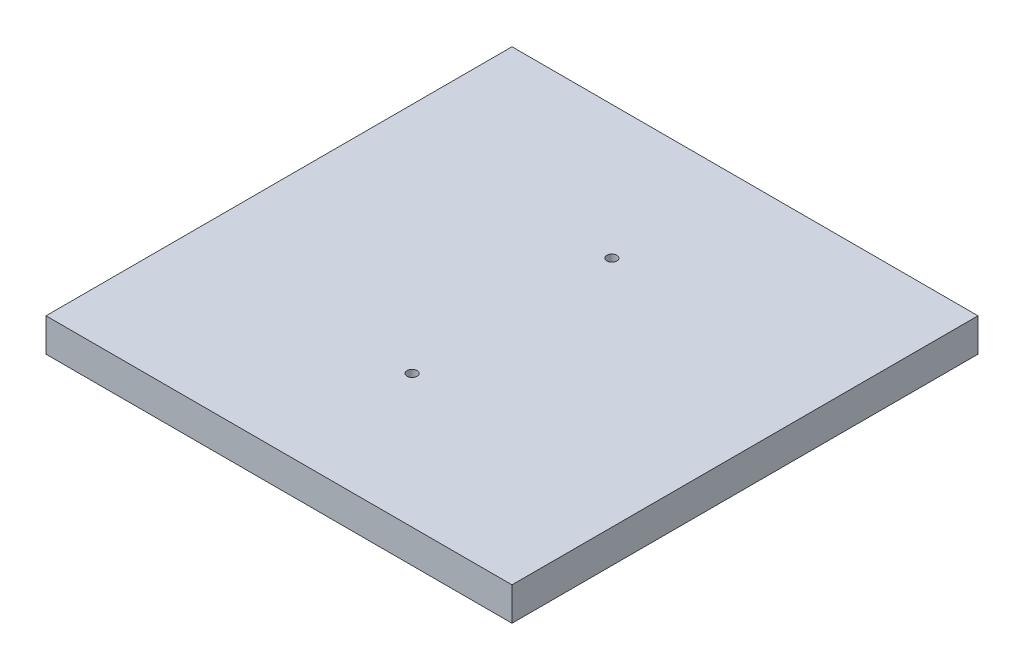
ISO-10303-21;
HEADER;
FILE_DESCRIPTION(('STEP AP214'),'2;1');
FILE_NAME('part.step','',(''),(''),'','','');
FILE_SCHEMA(('AUTOMOTIVE_DESIGN { 1 0 10303 214 1 1 1 1 }'));
ENDSEC;
DATA;
#1=APPLICATION_CONTEXT('core data for automotive mechanical design processes');
#2=APPLICATION_PROTOCOL_DEFINITION('international standard','automotive_design',2000,#1);
#3=PRODUCT_CONTEXT('',#1,'mechanical');
#4=PRODUCT('Part','Part','',(#3));
#5=PRODUCT_RELATED_PRODUCT_CATEGORY('part','',(#4));
#6=PRODUCT_DEFINITION_FORMATION('','',#4);
#7=PRODUCT_DEFINITION_CONTEXT('part definition',#1,'design');
#8=PRODUCT_DEFINITION('design','',#6,#7);
#9=PRODUCT_DEFINITION_SHAPE('','',#8);
#10=(LENGTH_UNIT() NAMED_UNIT(*) SI_UNIT(.MILLI.,.METRE.));
#11=(NAMED_UNIT(*) PLANE_ANGLE_UNIT() SI_UNIT($,.RADIAN.));
#12=(NAMED_UNIT(*) SI_UNIT($,.STERADIAN.) SOLID_ANGLE_UNIT());
#13=UNCERTAINTY_MEASURE_WITH_UNIT(LENGTH_MEASURE(1.E-05),#10,'distance_accuracy_value','');
#14=(GEOMETRIC_REPRESENTATION_CONTEXT(3) GLOBAL_UNCERTAINTY_ASSIGNED_CONTEXT((#13)) GLOBAL_UNIT_ASSIGNED_CONTEXT((#10,
#11,#12)) REPRESENTATION_CONTEXT('',''));
#15=CARTESIAN_POINT('',(0.,0.,0.));
#16=DIRECTION('',(0.,0.,1.));
#17=DIRECTION('',(1.,0.,0.));
#18=AXIS2_PLACEMENT_3D('',#15,#16,#17);
#19=CARTESIAN_POINT('',(-35.,-4.99999999999999,35.));
#20=DIRECTION('',(1.,0.,0.));
#21=DIRECTION('',(0.,0.,-1.));
#22=AXIS2_PLACEMENT_3D('',#19,#20,#21);
#23=PLANE('',#22);
#24=DIRECTION('',(0.,0.,-1.));
#25=VECTOR('',#24,1.);
#26=CARTESIAN_POINT('',(-35.,0.,35.));
#27=LINE('',#26,#25);
#28=CARTESIAN_POINT('',(-35.,0.,35.));
#29=VERTEX_POINT('',#28);
#30=CARTESIAN_POINT('',(-35.,0.,-35.));
#31=VERTEX_POINT('',#30);
#32=EDGE_CURVE('E95',#29,#31,#27,.T.);
#33=ORIENTED_EDGE('',*,*,#32,.T.);
#34=DIRECTION('',(0.,1.,0.));
#35=VECTOR('',#34,1.);
#36=CARTESIAN_POINT('',(-35.,-4.99999999999999,-35.));
#37=LINE('',#36,#35);
#38=CARTESIAN_POINT('',(-35.,-4.99999999999999,-35.));
#39=VERTEX_POINT('',#38);
#40=EDGE_CURVE('E11',#39,#31,#37,.T.);
#41=ORIENTED_EDGE('',*,*,#40,.F.);
#42=DIRECTION('',(0.,0.,-1.));
#43=VECTOR('',#42,1.);
#44=CARTESIAN_POINT('',(-35.,-4.99999999999999,35.));
#45=LINE('',#44,#43);
#46=CARTESIAN_POINT('',(-35.,-4.99999999999999,35.));
#47=VERTEX_POINT('',#46);
#48=EDGE_CURVE('E81',#47,#39,#45,.T.);
#49=ORIENTED_EDGE('',*,*,#48,.F.);
#50=DIRECTION('',(0.,1.,0.));
#51=VECTOR('',#50,1.);
#52=CARTESIAN_POINT('',(-35.,-4.99999999999999,35.));
#53=LINE('',#52,#51);
#54=EDGE_CURVE('E48',#47,#29,#53,.T.);
#55=ORIENTED_EDGE('',*,*,#54,.T.);
#56=EDGE_LOOP('',(#33,#41,#49,#55));
#57=FACE_BOUND('',#56,.T.);
#58=ADVANCED_FACE('F32',(#57),#23,.F.);
#59=CARTESIAN_POINT('',(-35.,-4.99999999999999,-35.));
#60=DIRECTION('',(0.,0.,1.));
#61=DIRECTION('',(1.,0.,0.));
#62=AXIS2_PLACEMENT_3D('',#59,#60,#61);
#63=PLANE('',#62);
#64=DIRECTION('',(1.,0.,0.));
#65=VECTOR('',#64,1.);
#66=CARTESIAN_POINT('',(-35.,0.,-35.));
#67=LINE('',#66,#65);
#68=CARTESIAN_POINT('',(35.,0.,-35.));
#69=VERTEX_POINT('',#68);
#70=EDGE_CURVE('E86',#31,#69,#67,.T.);
#71=ORIENTED_EDGE('',*,*,#70,.T.);
#72=DIRECTION('',(0.,1.,0.));
#73=VECTOR('',#72,1.);
#74=CARTESIAN_POINT('',(35.,-4.99999999999999,-35.));
#75=LINE('',#74,#73);
#76=CARTESIAN_POINT('',(35.,-4.99999999999999,-35.));
#77=VERTEX_POINT('',#76);
#78=EDGE_CURVE('E40',#77,#69,#75,.T.);
#79=ORIENTED_EDGE('',*,*,#78,.F.);
#80=DIRECTION('',(1.,0.,0.));
#81=VECTOR('',#80,1.);
#82=CARTESIAN_POINT('',(-35.,-4.99999999999999,-35.));
#83=LINE('',#82,#81);
#84=EDGE_CURVE('E73',#39,#77,#83,.T.);
#85=ORIENTED_EDGE('',*,*,#84,.F.);
#86=ORIENTED_EDGE('',*,*,#40,.T.);
#87=EDGE_LOOP('',(#71,#79,#85,#86));
#88=FACE_BOUND('',#87,.T.);
#89=ADVANCED_FACE('F85',(#88),#63,.F.);
#90=CARTESIAN_POINT('',(35.,-4.99999999999999,35.));
#91=DIRECTION('',(1.,0.,0.));
#92=DIRECTION('',(0.,0.,-1.));
#93=AXIS2_PLACEMENT_3D('',#90,#91,#92);
#94=PLANE('',#93);
#95=DIRECTION('',(0.,0.,-1.));
#96=VECTOR('',#95,1.);
#97=CARTESIAN_POINT('',(35.,0.,35.));
#98=LINE('',#97,#96);
#99=CARTESIAN_POINT('',(35.,0.,35.));
#100=VERTEX_POINT('',#99);
#101=EDGE_CURVE('E99',#100,#69,#98,.T.);
#102=ORIENTED_EDGE('',*,*,#101,.F.);
#103=DIRECTION('',(0.,1.,0.));
#104=VECTOR('',#103,1.);
#105=CARTESIAN_POINT('',(35.,-4.99999999999999,35.));
#106=LINE('',#105,#104);
#107=CARTESIAN_POINT('',(35.,-4.99999999999999,35.));
#108=VERTEX_POINT('',#107);
#109=EDGE_CURVE('E62',#108,#100,#106,.T.);
#110=ORIENTED_EDGE('',*,*,#109,.F.);
#111=DIRECTION('',(0.,0.,-1.));
#112=VECTOR('',#111,1.);
#113=CARTESIAN_POINT('',(35.,-4.99999999999999,35.));
#114=LINE('',#113,#112);
#115=EDGE_CURVE('E80',#108,#77,#114,.T.);
#116=ORIENTED_EDGE('',*,*,#115,.T.);
#117=ORIENTED_EDGE('',*,*,#78,.T.);
#118=EDGE_LOOP('',(#102,#110,#116,#117));
#119=FACE_BOUND('',#118,.T.);
#120=ADVANCED_FACE('F89',(#119),#94,.T.);
#121=CARTESIAN_POINT('',(-35.,-4.99999999999999,35.));
#122=DIRECTION('',(0.,0.,1.));
#123=DIRECTION('',(1.,0.,0.));
#124=AXIS2_PLACEMENT_3D('',#121,#122,#123);
#125=PLANE('',#124);
#126=DIRECTION('',(1.,0.,0.));
#127=VECTOR('',#126,1.);
#128=CARTESIAN_POINT('',(-35.,0.,35.));
#129=LINE('',#128,#127);
#130=EDGE_CURVE('E101',#29,#100,#129,.T.);
#131=ORIENTED_EDGE('',*,*,#130,.F.);
#132=ORIENTED_EDGE('',*,*,#54,.F.);
#133=DIRECTION('',(1.,0.,0.));
#134=VECTOR('',#133,1.);
#135=CARTESIAN_POINT('',(-35.,-4.99999999999999,35.));
#136=LINE('',#135,#134);
#137=EDGE_CURVE('E90',#47,#108,#136,.T.);
#138=ORIENTED_EDGE('',*,*,#137,.T.);
#139=ORIENTED_EDGE('',*,*,#109,.T.);
#140=EDGE_LOOP('',(#131,#132,#138,#139));
#141=FACE_BOUND('',#140,.T.);
#142=ADVANCED_FACE('F133',(#141),#125,.T.);
#143=CARTESIAN_POINT('',(0.,-4.99999999999999,0.));
#144=DIRECTION('',(0.,-1.,0.));
#145=DIRECTION('',(0.,0.,-1.));
#146=AXIS2_PLACEMENT_3D('',#143,#144,#145);
#147=PLANE('',#146);
#148=CARTESIAN_POINT('',(0.,-4.99999999999999,-15.));
#149=DIRECTION('',(0.,1.,0.));
#150=DIRECTION('',(0.,0.,1.));
#151=AXIS2_PLACEMENT_3D('',#148,#149,#150);
#152=CIRCLE('',#151,0.75);
#153=CARTESIAN_POINT('',(0.,-4.99999999999999,-14.25));
#154=VERTEX_POINT('',#153);
#155=EDGE_CURVE('E97',#154,#154,#152,.T.);
#156=ORIENTED_EDGE('',*,*,#155,.T.);
#157=EDGE_LOOP('',(#156));
#158=FACE_BOUND('',#157,.T.);
#159=CARTESIAN_POINT('',(0.,-4.99999999999999,15.));
#160=DIRECTION('',(0.,1.,0.));
#161=DIRECTION('',(0.,0.,-1.));
#162=AXIS2_PLACEMENT_3D('',#159,#160,#161);
#163=CIRCLE('',#162,0.75);
#164=CARTESIAN_POINT('',(0.,-4.99999999999999,14.25));
#165=VERTEX_POINT('',#164);
#166=EDGE_CURVE('E110',#165,#165,#163,.T.);
#167=ORIENTED_EDGE('',*,*,#166,.T.);
#168=EDGE_LOOP('',(#167));
#169=FACE_BOUND('',#168,.T.);
#170=ORIENTED_EDGE('',*,*,#48,.T.);
#171=ORIENTED_EDGE('',*,*,#84,.T.);
#172=ORIENTED_EDGE('',*,*,#115,.F.);
#173=ORIENTED_EDGE('',*,*,#137,.F.);
#174=EDGE_LOOP('',(#170,#171,#172,#173));
#175=FACE_BOUND('',#174,.T.);
#176=ADVANCED_FACE('F77',(#158,#169,#175),#147,.T.);
#177=CARTESIAN_POINT('',(0.,0.,0.));
#178=DIRECTION('',(0.,-1.,0.));
#179=DIRECTION('',(0.,0.,-1.));
#180=AXIS2_PLACEMENT_3D('',#177,#178,#179);
#181=PLANE('',#180);
#182=CARTESIAN_POINT('',(0.,0.,-15.));
#183=DIRECTION('',(0.,1.,0.));
#184=DIRECTION('',(0.,0.,1.));
#185=AXIS2_PLACEMENT_3D('',#182,#183,#184);
#186=CIRCLE('',#185,0.75);
#187=CARTESIAN_POINT('',(0.,0.,-14.25));
#188=VERTEX_POINT('',#187);
#189=EDGE_CURVE('E113',#188,#188,#186,.T.);
#190=ORIENTED_EDGE('',*,*,#189,.F.);
#191=EDGE_LOOP('',(#190));
#192=FACE_BOUND('',#191,.T.);
#193=CARTESIAN_POINT('',(0.,0.,15.));
#194=DIRECTION('',(0.,1.,0.));
#195=DIRECTION('',(0.,0.,-1.));
#196=AXIS2_PLACEMENT_3D('',#193,#194,#195);
#197=CIRCLE('',#196,0.75);
#198=CARTESIAN_POINT('',(0.,0.,14.25));
#199=VERTEX_POINT('',#198);
#200=EDGE_CURVE('E107',#199,#199,#197,.T.);
#201=ORIENTED_EDGE('',*,*,#200,.F.);
#202=EDGE_LOOP('',(#201));
#203=FACE_BOUND('',#202,.T.);
#204=ORIENTED_EDGE('',*,*,#32,.F.);
#205=ORIENTED_EDGE('',*,*,#130,.T.);
#206=ORIENTED_EDGE('',*,*,#101,.T.);
#207=ORIENTED_EDGE('',*,*,#70,.F.);
#208=EDGE_LOOP('',(#204,#205,#206,#207));
#209=FACE_BOUND('',#208,.T.);
#210=ADVANCED_FACE('F128',(#192,#203,#209),#181,.F.);
#211=CARTESIAN_POINT('',(0.,-4.99999999999999,15.));
#212=DIRECTION('',(0.,1.,0.));
#213=DIRECTION('',(0.,0.,1.));
#214=AXIS2_PLACEMENT_3D('',#211,#212,#213);
#215=CYLINDRICAL_SURFACE('',#214,0.75);
#216=ORIENTED_EDGE('',*,*,#166,.F.);
#217=EDGE_LOOP('',(#216));
#218=FACE_BOUND('',#217,.T.);
#219=ORIENTED_EDGE('',*,*,#200,.T.);
#220=EDGE_LOOP('',(#219));
#221=FACE_BOUND('',#220,.T.);
#222=ADVANCED_FACE('F124',(#218,#221),#215,.F.);
#223=CARTESIAN_POINT('',(0.,-4.99999999999999,-15.));
#224=DIRECTION('',(0.,1.,0.));
#225=DIRECTION('',(0.,0.,1.));
#226=AXIS2_PLACEMENT_3D('',#223,#224,#225);
#227=CYLINDRICAL_SURFACE('',#226,0.75);
#228=ORIENTED_EDGE('',*,*,#155,.F.);
#229=EDGE_LOOP('',(#228));
#230=FACE_BOUND('',#229,.T.);
#231=ORIENTED_EDGE('',*,*,#189,.T.);
#232=EDGE_LOOP('',(#231));
#233=FACE_BOUND('',#232,.T.);
#234=ADVANCED_FACE('F121',(#230,#233),#227,.F.);
#235=CLOSED_SHELL('',(#58,#89,#120,#142,#176,#210,#222,#234));
#236=MANIFOLD_SOLID_BREP('B2',#235);
#237=ADVANCED_BREP_SHAPE_REPRESENTATION('',(#18,#236),#14);
#238=SHAPE_DEFINITION_REPRESENTATION(#9,#237);
ENDSEC;
END-ISO-10303-21;
